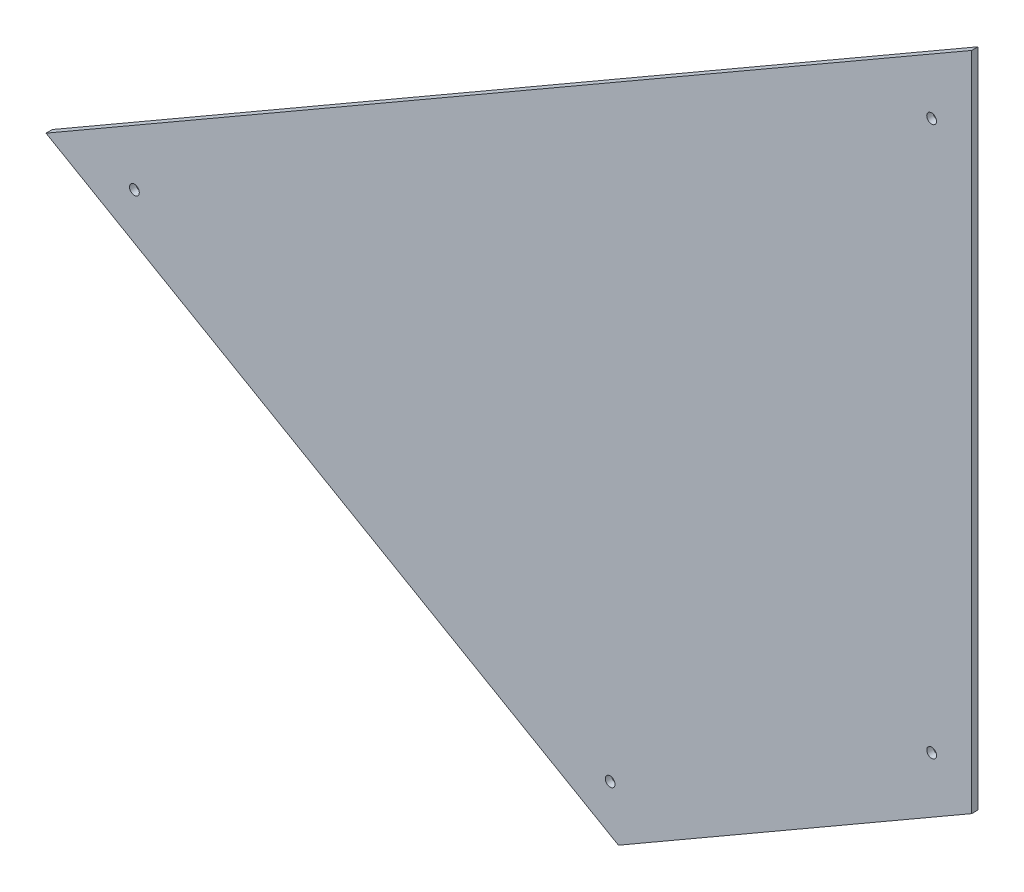
ISO-10303-21;
HEADER;
FILE_DESCRIPTION(('STEP AP214'),'2;1');
FILE_NAME('part.step','',(''),(''),'','','');
FILE_SCHEMA(('AUTOMOTIVE_DESIGN { 1 0 10303 214 1 1 1 1 }'));
ENDSEC;
DATA;
#1=APPLICATION_CONTEXT('core data for automotive mechanical design processes');
#2=APPLICATION_PROTOCOL_DEFINITION('international standard','automotive_design',2000,#1);
#3=PRODUCT_CONTEXT('',#1,'mechanical');
#4=PRODUCT('Part','Part','',(#3));
#5=PRODUCT_RELATED_PRODUCT_CATEGORY('part','',(#4));
#6=PRODUCT_DEFINITION_FORMATION('','',#4);
#7=PRODUCT_DEFINITION_CONTEXT('part definition',#1,'design');
#8=PRODUCT_DEFINITION('design','',#6,#7);
#9=PRODUCT_DEFINITION_SHAPE('','',#8);
#10=(LENGTH_UNIT() NAMED_UNIT(*) SI_UNIT(.MILLI.,.METRE.));
#11=(NAMED_UNIT(*) PLANE_ANGLE_UNIT() SI_UNIT($,.RADIAN.));
#12=(NAMED_UNIT(*) SI_UNIT($,.STERADIAN.) SOLID_ANGLE_UNIT());
#13=UNCERTAINTY_MEASURE_WITH_UNIT(LENGTH_MEASURE(1.E-05),#10,'distance_accuracy_value','');
#14=(GEOMETRIC_REPRESENTATION_CONTEXT(3) GLOBAL_UNCERTAINTY_ASSIGNED_CONTEXT((#13)) GLOBAL_UNIT_ASSIGNED_CONTEXT((#10,
#11,#12)) REPRESENTATION_CONTEXT('',''));
#15=CARTESIAN_POINT('',(0.,0.,0.));
#16=DIRECTION('',(0.,0.,1.));
#17=DIRECTION('',(1.,0.,0.));
#18=AXIS2_PLACEMENT_3D('',#15,#16,#17);
#19=CARTESIAN_POINT('',(0.,-209.317404070278,2.));
#20=DIRECTION('',(-1.,0.,0.));
#21=DIRECTION('',(0.,-1.,0.));
#22=AXIS2_PLACEMENT_3D('',#19,#20,#21);
#23=PLANE('',#22);
#24=DIRECTION('',(0.,1.,0.));
#25=VECTOR('',#24,1.);
#26=CARTESIAN_POINT('',(0.,-209.317404070278,0.));
#27=LINE('',#26,#25);
#28=CARTESIAN_POINT('',(0.,-209.317404070278,0.));
#29=VERTEX_POINT('',#28);
#30=CARTESIAN_POINT('',(0.,0.,0.));
#31=VERTEX_POINT('',#30);
#32=EDGE_CURVE('E98',#29,#31,#27,.T.);
#33=ORIENTED_EDGE('',*,*,#32,.T.);
#34=DIRECTION('',(0.,0.,-1.));
#35=VECTOR('',#34,1.);
#36=CARTESIAN_POINT('',(0.,0.,2.));
#37=LINE('',#36,#35);
#38=CARTESIAN_POINT('',(0.,0.,2.));
#39=VERTEX_POINT('',#38);
#40=EDGE_CURVE('E11',#39,#31,#37,.T.);
#41=ORIENTED_EDGE('',*,*,#40,.F.);
#42=DIRECTION('',(0.,1.,0.));
#43=VECTOR('',#42,1.);
#44=CARTESIAN_POINT('',(0.,-209.317404070278,2.));
#45=LINE('',#44,#43);
#46=CARTESIAN_POINT('',(0.,-209.317404070278,2.));
#47=VERTEX_POINT('',#46);
#48=EDGE_CURVE('E86',#47,#39,#45,.T.);
#49=ORIENTED_EDGE('',*,*,#48,.F.);
#50=DIRECTION('',(0.,0.,-1.));
#51=VECTOR('',#50,1.);
#52=CARTESIAN_POINT('',(0.,-209.317404070278,2.));
#53=LINE('',#52,#51);
#54=EDGE_CURVE('E94',#47,#29,#53,.T.);
#55=ORIENTED_EDGE('',*,*,#54,.T.);
#56=EDGE_LOOP('',(#33,#41,#49,#55));
#57=FACE_BOUND('',#56,.T.);
#58=ADVANCED_FACE('F35',(#57),#23,.F.);
#59=CARTESIAN_POINT('',(0.,0.,2.));
#60=DIRECTION('',(0.500032954569126,-0.866006376619058,0.));
#61=DIRECTION('',(0.866006376619058,0.500032954569126,0.));
#62=AXIS2_PLACEMENT_3D('',#59,#60,#61);
#63=PLANE('',#62);
#64=DIRECTION('',(-0.866006376619058,-0.500032954569126,0.));
#65=VECTOR('',#64,1.);
#66=CARTESIAN_POINT('',(0.,0.,0.));
#67=LINE('',#66,#65);
#68=CARTESIAN_POINT('',(-293.143158485554,-169.261155121651,0.));
#69=VERTEX_POINT('',#68);
#70=EDGE_CURVE('E90',#31,#69,#67,.T.);
#71=ORIENTED_EDGE('',*,*,#70,.T.);
#72=DIRECTION('',(0.,0.,-1.));
#73=VECTOR('',#72,1.);
#74=CARTESIAN_POINT('',(-293.143158485554,-169.261155121651,2.));
#75=LINE('',#74,#73);
#76=CARTESIAN_POINT('',(-293.143158485554,-169.261155121651,2.));
#77=VERTEX_POINT('',#76);
#78=EDGE_CURVE('E43',#77,#69,#75,.T.);
#79=ORIENTED_EDGE('',*,*,#78,.F.);
#80=DIRECTION('',(-0.866006376619058,-0.500032954569126,0.));
#81=VECTOR('',#80,1.);
#82=CARTESIAN_POINT('',(0.,0.,2.));
#83=LINE('',#82,#81);
#84=EDGE_CURVE('E81',#39,#77,#83,.T.);
#85=ORIENTED_EDGE('',*,*,#84,.F.);
#86=ORIENTED_EDGE('',*,*,#40,.T.);
#87=EDGE_LOOP('',(#71,#79,#85,#86));
#88=FACE_BOUND('',#87,.T.);
#89=ADVANCED_FACE('F89',(#88),#63,.F.);
#90=CARTESIAN_POINT('',(-293.143158485554,-169.261155121651,2.));
#91=DIRECTION('',(0.499934088689747,0.866063454353058,0.));
#92=DIRECTION('',(-0.866063454353058,0.499934088689747,0.));
#93=AXIS2_PLACEMENT_3D('',#90,#91,#92);
#94=PLANE('',#93);
#95=DIRECTION('',(0.866063454353058,-0.499934088689747,0.));
#96=VECTOR('',#95,1.);
#97=CARTESIAN_POINT('',(-293.143158485554,-169.261155121651,0.));
#98=LINE('',#97,#96);
#99=CARTESIAN_POINT('',(-111.861004460234,-273.906060772429,0.));
#100=VERTEX_POINT('',#99);
#101=EDGE_CURVE('E68',#69,#100,#98,.T.);
#102=ORIENTED_EDGE('',*,*,#101,.T.);
#103=DIRECTION('',(0.,0.,-1.));
#104=VECTOR('',#103,1.);
#105=CARTESIAN_POINT('',(-111.861004460234,-273.906060772429,2.));
#106=LINE('',#105,#104);
#107=CARTESIAN_POINT('',(-111.861004460234,-273.906060772429,2.));
#108=VERTEX_POINT('',#107);
#109=EDGE_CURVE('E91',#108,#100,#106,.T.);
#110=ORIENTED_EDGE('',*,*,#109,.F.);
#111=DIRECTION('',(0.866063454353058,-0.499934088689747,0.));
#112=VECTOR('',#111,1.);
#113=CARTESIAN_POINT('',(-293.143158485554,-169.261155121651,2.));
#114=LINE('',#113,#112);
#115=EDGE_CURVE('E84',#77,#108,#114,.T.);
#116=ORIENTED_EDGE('',*,*,#115,.F.);
#117=ORIENTED_EDGE('',*,*,#78,.T.);
#118=EDGE_LOOP('',(#102,#110,#116,#117));
#119=FACE_BOUND('',#118,.T.);
#120=ADVANCED_FACE('F92',(#119),#94,.F.);
#121=CARTESIAN_POINT('',(-111.861004460234,-273.906060772429,2.));
#122=DIRECTION('',(-0.500032954569132,0.866006376619055,0.));
#123=DIRECTION('',(-0.866006376619055,-0.500032954569132,0.));
#124=AXIS2_PLACEMENT_3D('',#121,#122,#123);
#125=PLANE('',#124);
#126=DIRECTION('',(0.866006376619055,0.500032954569132,0.));
#127=VECTOR('',#126,1.);
#128=CARTESIAN_POINT('',(-111.861004460234,-273.906060772429,0.));
#129=LINE('',#128,#127);
#130=EDGE_CURVE('E74',#100,#29,#129,.T.);
#131=ORIENTED_EDGE('',*,*,#130,.T.);
#132=ORIENTED_EDGE('',*,*,#54,.F.);
#133=DIRECTION('',(0.866006376619055,0.500032954569132,0.));
#134=VECTOR('',#133,1.);
#135=CARTESIAN_POINT('',(-111.861004460234,-273.906060772429,2.));
#136=LINE('',#135,#134);
#137=EDGE_CURVE('E51',#108,#47,#136,.T.);
#138=ORIENTED_EDGE('',*,*,#137,.F.);
#139=ORIENTED_EDGE('',*,*,#109,.T.);
#140=EDGE_LOOP('',(#131,#132,#138,#139));
#141=FACE_BOUND('',#140,.T.);
#142=ADVANCED_FACE('F106',(#141),#125,.F.);
#143=CARTESIAN_POINT('',(0.,0.,2.));
#144=DIRECTION('',(0.,0.,-1.));
#145=DIRECTION('',(-1.,0.,0.));
#146=AXIS2_PLACEMENT_3D('',#143,#144,#145);
#147=PLANE('',#146);
#148=CARTESIAN_POINT('',(-265.149449722092,-170.776394274481,2.));
#149=DIRECTION('',(0.,0.,-1.));
#150=DIRECTION('',(-1.,0.,0.));
#151=AXIS2_PLACEMENT_3D('',#148,#149,#150);
#152=CIRCLE('',#151,1.55000000000005);
#153=CARTESIAN_POINT('',(-266.699449722092,-170.776394274481,2.));
#154=VERTEX_POINT('',#153);
#155=EDGE_CURVE('E127',#154,#154,#152,.T.);
#156=ORIENTED_EDGE('',*,*,#155,.T.);
#157=EDGE_LOOP('',(#156));
#158=FACE_BOUND('',#157,.T.);
#159=CARTESIAN_POINT('',(-114.489281174022,-257.744795592357,2.));
#160=DIRECTION('',(0.,0.,-1.));
#161=DIRECTION('',(-1.,0.,0.));
#162=AXIS2_PLACEMENT_3D('',#159,#160,#161);
#163=CIRCLE('',#162,1.54999999999996);
#164=CARTESIAN_POINT('',(-116.039281174022,-257.744795592357,2.));
#165=VERTEX_POINT('',#164);
#166=EDGE_CURVE('E121',#165,#165,#163,.T.);
#167=ORIENTED_EDGE('',*,*,#166,.T.);
#168=EDGE_LOOP('',(#167));
#169=FACE_BOUND('',#168,.T.);
#170=CARTESIAN_POINT('',(-12.6827160248369,-198.961582280666,2.));
#171=DIRECTION('',(0.,0.,-1.));
#172=DIRECTION('',(-1.,0.,0.));
#173=AXIS2_PLACEMENT_3D('',#170,#171,#172);
#174=CIRCLE('',#173,1.54999999999999);
#175=CARTESIAN_POINT('',(-14.2327160248369,-198.961582280666,2.));
#176=VERTEX_POINT('',#175);
#177=EDGE_CURVE('E115',#176,#176,#174,.T.);
#178=ORIENTED_EDGE('',*,*,#177,.T.);
#179=EDGE_LOOP('',(#178));
#180=FACE_BOUND('',#179,.T.);
#181=CARTESIAN_POINT('',(-12.6827160248369,-25.0018478168542,2.));
#182=DIRECTION('',(0.,0.,-1.));
#183=DIRECTION('',(-1.,0.,0.));
#184=AXIS2_PLACEMENT_3D('',#181,#182,#183);
#185=CIRCLE('',#184,1.55);
#186=CARTESIAN_POINT('',(-14.2327160248369,-25.0018478168542,2.));
#187=VERTEX_POINT('',#186);
#188=EDGE_CURVE('E101',#187,#187,#185,.T.);
#189=ORIENTED_EDGE('',*,*,#188,.T.);
#190=EDGE_LOOP('',(#189));
#191=FACE_BOUND('',#190,.T.);
#192=ORIENTED_EDGE('',*,*,#48,.T.);
#193=ORIENTED_EDGE('',*,*,#84,.T.);
#194=ORIENTED_EDGE('',*,*,#115,.T.);
#195=ORIENTED_EDGE('',*,*,#137,.T.);
#196=EDGE_LOOP('',(#192,#193,#194,#195));
#197=FACE_BOUND('',#196,.T.);
#198=ADVANCED_FACE('F82',(#158,#169,#180,#191,#197),#147,.F.);
#199=CARTESIAN_POINT('',(0.,0.,0.));
#200=DIRECTION('',(0.,0.,-1.));
#201=DIRECTION('',(-1.,0.,0.));
#202=AXIS2_PLACEMENT_3D('',#199,#200,#201);
#203=PLANE('',#202);
#204=CARTESIAN_POINT('',(-265.149449722092,-170.776394274481,0.));
#205=DIRECTION('',(0.,0.,-1.));
#206=DIRECTION('',(-1.,0.,0.));
#207=AXIS2_PLACEMENT_3D('',#204,#205,#206);
#208=CIRCLE('',#207,1.55000000000005);
#209=CARTESIAN_POINT('',(-266.699449722092,-170.776394274481,0.));
#210=VERTEX_POINT('',#209);
#211=EDGE_CURVE('E130',#210,#210,#208,.T.);
#212=ORIENTED_EDGE('',*,*,#211,.F.);
#213=EDGE_LOOP('',(#212));
#214=FACE_BOUND('',#213,.T.);
#215=CARTESIAN_POINT('',(-114.489281174022,-257.744795592357,0.));
#216=DIRECTION('',(0.,0.,-1.));
#217=DIRECTION('',(-1.,0.,0.));
#218=AXIS2_PLACEMENT_3D('',#215,#216,#217);
#219=CIRCLE('',#218,1.54999999999996);
#220=CARTESIAN_POINT('',(-116.039281174022,-257.744795592357,0.));
#221=VERTEX_POINT('',#220);
#222=EDGE_CURVE('E124',#221,#221,#219,.T.);
#223=ORIENTED_EDGE('',*,*,#222,.F.);
#224=EDGE_LOOP('',(#223));
#225=FACE_BOUND('',#224,.T.);
#226=CARTESIAN_POINT('',(-12.6827160248369,-198.961582280666,0.));
#227=DIRECTION('',(0.,0.,-1.));
#228=DIRECTION('',(-1.,0.,0.));
#229=AXIS2_PLACEMENT_3D('',#226,#227,#228);
#230=CIRCLE('',#229,1.54999999999999);
#231=CARTESIAN_POINT('',(-14.2327160248369,-198.961582280666,0.));
#232=VERTEX_POINT('',#231);
#233=EDGE_CURVE('E118',#232,#232,#230,.T.);
#234=ORIENTED_EDGE('',*,*,#233,.F.);
#235=EDGE_LOOP('',(#234));
#236=FACE_BOUND('',#235,.T.);
#237=CARTESIAN_POINT('',(-12.6827160248369,-25.0018478168542,0.));
#238=DIRECTION('',(0.,0.,-1.));
#239=DIRECTION('',(-1.,0.,0.));
#240=AXIS2_PLACEMENT_3D('',#237,#238,#239);
#241=CIRCLE('',#240,1.55);
#242=CARTESIAN_POINT('',(-14.2327160248369,-25.0018478168542,0.));
#243=VERTEX_POINT('',#242);
#244=EDGE_CURVE('E112',#243,#243,#241,.T.);
#245=ORIENTED_EDGE('',*,*,#244,.F.);
#246=EDGE_LOOP('',(#245));
#247=FACE_BOUND('',#246,.T.);
#248=ORIENTED_EDGE('',*,*,#32,.F.);
#249=ORIENTED_EDGE('',*,*,#130,.F.);
#250=ORIENTED_EDGE('',*,*,#101,.F.);
#251=ORIENTED_EDGE('',*,*,#70,.F.);
#252=EDGE_LOOP('',(#248,#249,#250,#251));
#253=FACE_BOUND('',#252,.T.);
#254=ADVANCED_FACE('F109',(#214,#225,#236,#247,#253),#203,.T.);
#255=CARTESIAN_POINT('',(-12.6827160248369,-25.0018478168542,2.));
#256=DIRECTION('',(0.,0.,-1.));
#257=DIRECTION('',(-1.,0.,0.));
#258=AXIS2_PLACEMENT_3D('',#255,#256,#257);
#259=CYLINDRICAL_SURFACE('',#258,1.55);
#260=ORIENTED_EDGE('',*,*,#188,.F.);
#261=EDGE_LOOP('',(#260));
#262=FACE_BOUND('',#261,.T.);
#263=ORIENTED_EDGE('',*,*,#244,.T.);
#264=EDGE_LOOP('',(#263));
#265=FACE_BOUND('',#264,.T.);
#266=ADVANCED_FACE('F147',(#262,#265),#259,.F.);
#267=CARTESIAN_POINT('',(-12.6827160248369,-198.961582280666,2.));
#268=DIRECTION('',(0.,0.,-1.));
#269=DIRECTION('',(-1.,0.,0.));
#270=AXIS2_PLACEMENT_3D('',#267,#268,#269);
#271=CYLINDRICAL_SURFACE('',#270,1.54999999999999);
#272=ORIENTED_EDGE('',*,*,#177,.F.);
#273=EDGE_LOOP('',(#272));
#274=FACE_BOUND('',#273,.T.);
#275=ORIENTED_EDGE('',*,*,#233,.T.);
#276=EDGE_LOOP('',(#275));
#277=FACE_BOUND('',#276,.T.);
#278=ADVANCED_FACE('F156',(#274,#277),#271,.F.);
#279=CARTESIAN_POINT('',(-114.489281174022,-257.744795592357,2.));
#280=DIRECTION('',(0.,0.,-1.));
#281=DIRECTION('',(-1.,0.,0.));
#282=AXIS2_PLACEMENT_3D('',#279,#280,#281);
#283=CYLINDRICAL_SURFACE('',#282,1.54999999999996);
#284=ORIENTED_EDGE('',*,*,#166,.F.);
#285=EDGE_LOOP('',(#284));
#286=FACE_BOUND('',#285,.T.);
#287=ORIENTED_EDGE('',*,*,#222,.T.);
#288=EDGE_LOOP('',(#287));
#289=FACE_BOUND('',#288,.T.);
#290=ADVANCED_FACE('F141',(#286,#289),#283,.F.);
#291=CARTESIAN_POINT('',(-265.149449722092,-170.776394274481,2.));
#292=DIRECTION('',(0.,0.,-1.));
#293=DIRECTION('',(-1.,0.,0.));
#294=AXIS2_PLACEMENT_3D('',#291,#292,#293);
#295=CYLINDRICAL_SURFACE('',#294,1.55000000000005);
#296=ORIENTED_EDGE('',*,*,#155,.F.);
#297=EDGE_LOOP('',(#296));
#298=FACE_BOUND('',#297,.T.);
#299=ORIENTED_EDGE('',*,*,#211,.T.);
#300=EDGE_LOOP('',(#299));
#301=FACE_BOUND('',#300,.T.);
#302=ADVANCED_FACE('F138',(#298,#301),#295,.F.);
#303=CLOSED_SHELL('',(#58,#89,#120,#142,#198,#254,#266,#278,#290,#302));
#304=MANIFOLD_SOLID_BREP('B2',#303);
#305=ADVANCED_BREP_SHAPE_REPRESENTATION('',(#18,#304),#14);
#306=SHAPE_DEFINITION_REPRESENTATION(#9,#305);
ENDSEC;
END-ISO-10303-21;
